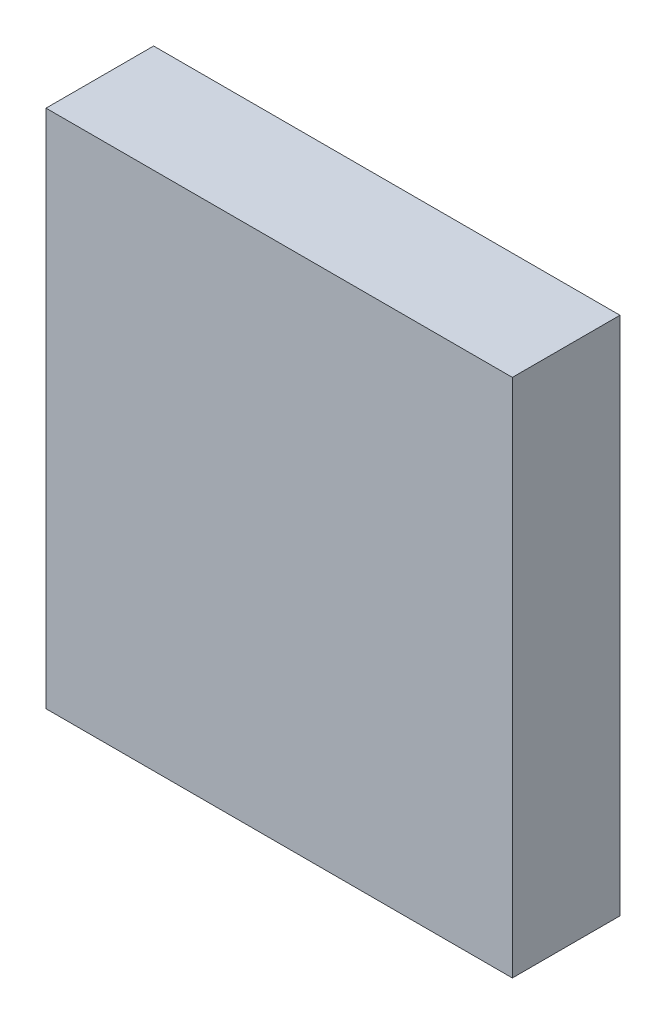
ISO-10303-21;
HEADER;
FILE_DESCRIPTION(('STEP AP214'),'2;1');
FILE_NAME('part.step','',(''),(''),'','','');
FILE_SCHEMA(('AUTOMOTIVE_DESIGN { 1 0 10303 214 1 1 1 1 }'));
ENDSEC;
DATA;
#1=APPLICATION_CONTEXT('core data for automotive mechanical design processes');
#2=APPLICATION_PROTOCOL_DEFINITION('international standard','automotive_design',2000,#1);
#3=PRODUCT_CONTEXT('',#1,'mechanical');
#4=PRODUCT('Part','Part','',(#3));
#5=PRODUCT_RELATED_PRODUCT_CATEGORY('part','',(#4));
#6=PRODUCT_DEFINITION_FORMATION('','',#4);
#7=PRODUCT_DEFINITION_CONTEXT('part definition',#1,'design');
#8=PRODUCT_DEFINITION('design','',#6,#7);
#9=PRODUCT_DEFINITION_SHAPE('','',#8);
#10=(LENGTH_UNIT() NAMED_UNIT(*) SI_UNIT(.MILLI.,.METRE.));
#11=(NAMED_UNIT(*) PLANE_ANGLE_UNIT() SI_UNIT($,.RADIAN.));
#12=(NAMED_UNIT(*) SI_UNIT($,.STERADIAN.) SOLID_ANGLE_UNIT());
#13=UNCERTAINTY_MEASURE_WITH_UNIT(LENGTH_MEASURE(1.E-05),#10,'distance_accuracy_value','');
#14=(GEOMETRIC_REPRESENTATION_CONTEXT(3) GLOBAL_UNCERTAINTY_ASSIGNED_CONTEXT((#13)) GLOBAL_UNIT_ASSIGNED_CONTEXT((#10,
#11,#12)) REPRESENTATION_CONTEXT('',''));
#15=CARTESIAN_POINT('',(0.,0.,0.));
#16=DIRECTION('',(0.,0.,1.));
#17=DIRECTION('',(1.,0.,0.));
#18=AXIS2_PLACEMENT_3D('',#15,#16,#17);
#19=CARTESIAN_POINT('',(0.,0.,0.5999988));
#20=DIRECTION('',(0.,0.,1.));
#21=DIRECTION('',(1.,0.,0.));
#22=AXIS2_PLACEMENT_3D('',#19,#20,#21);
#23=PLANE('',#22);
#24=DIRECTION('',(0.,1.,0.));
#25=VECTOR('',#24,1.);
#26=CARTESIAN_POINT('',(1.29999994,-1.44999964,0.5999988));
#27=LINE('',#26,#25);
#28=CARTESIAN_POINT('',(1.29999994,-1.44999964,0.5999988));
#29=VERTEX_POINT('',#28);
#30=CARTESIAN_POINT('',(1.29999994,1.44999964,0.5999988));
#31=VERTEX_POINT('',#30);
#32=EDGE_CURVE('E84',#29,#31,#27,.T.);
#33=ORIENTED_EDGE('',*,*,#32,.T.);
#34=DIRECTION('',(-1.,0.,0.));
#35=VECTOR('',#34,1.);
#36=CARTESIAN_POINT('',(1.29999994,1.44999964,0.5999988));
#37=LINE('',#36,#35);
#38=CARTESIAN_POINT('',(-1.29999994,1.44999964,0.5999988));
#39=VERTEX_POINT('',#38);
#40=EDGE_CURVE('E74',#31,#39,#37,.T.);
#41=ORIENTED_EDGE('',*,*,#40,.T.);
#42=DIRECTION('',(0.,-1.,0.));
#43=VECTOR('',#42,1.);
#44=CARTESIAN_POINT('',(-1.29999994,1.44999964,0.5999988));
#45=LINE('',#44,#43);
#46=CARTESIAN_POINT('',(-1.29999994,-1.44999964,0.5999988));
#47=VERTEX_POINT('',#46);
#48=EDGE_CURVE('E56',#39,#47,#45,.T.);
#49=ORIENTED_EDGE('',*,*,#48,.T.);
#50=DIRECTION('',(1.,0.,0.));
#51=VECTOR('',#50,1.);
#52=CARTESIAN_POINT('',(-1.29999994,-1.44999964,0.5999988));
#53=LINE('',#52,#51);
#54=EDGE_CURVE('E11',#47,#29,#53,.T.);
#55=ORIENTED_EDGE('',*,*,#54,.T.);
#56=EDGE_LOOP('',(#33,#41,#49,#55));
#57=FACE_BOUND('',#56,.T.);
#58=ADVANCED_FACE('F16',(#57),#23,.T.);
#59=CARTESIAN_POINT('',(0.,0.,0.));
#60=DIRECTION('',(0.,0.,1.));
#61=DIRECTION('',(1.,0.,0.));
#62=AXIS2_PLACEMENT_3D('',#59,#60,#61);
#63=PLANE('',#62);
#64=DIRECTION('',(0.,1.,0.));
#65=VECTOR('',#64,1.);
#66=CARTESIAN_POINT('',(1.29999994,-1.44999964,0.));
#67=LINE('',#66,#65);
#68=CARTESIAN_POINT('',(1.29999994,-1.44999964,0.));
#69=VERTEX_POINT('',#68);
#70=CARTESIAN_POINT('',(1.29999994,1.44999964,0.));
#71=VERTEX_POINT('',#70);
#72=EDGE_CURVE('E96',#69,#71,#67,.T.);
#73=ORIENTED_EDGE('',*,*,#72,.F.);
#74=DIRECTION('',(1.,0.,0.));
#75=VECTOR('',#74,1.);
#76=CARTESIAN_POINT('',(-1.29999994,-1.44999964,0.));
#77=LINE('',#76,#75);
#78=CARTESIAN_POINT('',(-1.29999994,-1.44999964,0.));
#79=VERTEX_POINT('',#78);
#80=EDGE_CURVE('E25',#79,#69,#77,.T.);
#81=ORIENTED_EDGE('',*,*,#80,.F.);
#82=DIRECTION('',(0.,-1.,0.));
#83=VECTOR('',#82,1.);
#84=CARTESIAN_POINT('',(-1.29999994,1.44999964,0.));
#85=LINE('',#84,#83);
#86=CARTESIAN_POINT('',(-1.29999994,1.44999964,0.));
#87=VERTEX_POINT('',#86);
#88=EDGE_CURVE('E66',#87,#79,#85,.T.);
#89=ORIENTED_EDGE('',*,*,#88,.F.);
#90=DIRECTION('',(-1.,0.,0.));
#91=VECTOR('',#90,1.);
#92=CARTESIAN_POINT('',(1.29999994,1.44999964,0.));
#93=LINE('',#92,#91);
#94=EDGE_CURVE('E79',#71,#87,#93,.T.);
#95=ORIENTED_EDGE('',*,*,#94,.F.);
#96=EDGE_LOOP('',(#73,#81,#89,#95));
#97=FACE_BOUND('',#96,.T.);
#98=ADVANCED_FACE('F176',(#97),#63,.F.);
#99=CARTESIAN_POINT('',(-1.29999994,-1.44999964,0.));
#100=DIRECTION('',(0.,1.,0.));
#101=DIRECTION('',(1.,0.,0.));
#102=AXIS2_PLACEMENT_3D('',#99,#100,#101);
#103=PLANE('',#102);
#104=DIRECTION('',(0.,0.,1.));
#105=VECTOR('',#104,1.);
#106=CARTESIAN_POINT('',(-1.29999994,-1.44999964,0.));
#107=LINE('',#106,#105);
#108=EDGE_CURVE('E105',#79,#47,#107,.T.);
#109=ORIENTED_EDGE('',*,*,#108,.F.);
#110=ORIENTED_EDGE('',*,*,#80,.T.);
#111=DIRECTION('',(0.,0.,1.));
#112=VECTOR('',#111,1.);
#113=CARTESIAN_POINT('',(1.29999994,-1.44999964,0.));
#114=LINE('',#113,#112);
#115=EDGE_CURVE('E90',#69,#29,#114,.T.);
#116=ORIENTED_EDGE('',*,*,#115,.T.);
#117=ORIENTED_EDGE('',*,*,#54,.F.);
#118=EDGE_LOOP('',(#109,#110,#116,#117));
#119=FACE_BOUND('',#118,.T.);
#120=ADVANCED_FACE('F94',(#119),#103,.F.);
#121=CARTESIAN_POINT('',(-1.29999994,1.44999964,0.));
#122=DIRECTION('',(1.,0.,0.));
#123=DIRECTION('',(0.,1.,0.));
#124=AXIS2_PLACEMENT_3D('',#121,#122,#123);
#125=PLANE('',#124);
#126=DIRECTION('',(0.,0.,1.));
#127=VECTOR('',#126,1.);
#128=CARTESIAN_POINT('',(-1.29999994,1.44999964,0.));
#129=LINE('',#128,#127);
#130=EDGE_CURVE('E116',#87,#39,#129,.T.);
#131=ORIENTED_EDGE('',*,*,#130,.F.);
#132=ORIENTED_EDGE('',*,*,#88,.T.);
#133=ORIENTED_EDGE('',*,*,#108,.T.);
#134=ORIENTED_EDGE('',*,*,#48,.F.);
#135=EDGE_LOOP('',(#131,#132,#133,#134));
#136=FACE_BOUND('',#135,.T.);
#137=ADVANCED_FACE('F159',(#136),#125,.F.);
#138=CARTESIAN_POINT('',(1.29999994,1.44999964,0.));
#139=DIRECTION('',(0.,-1.,0.));
#140=DIRECTION('',(0.,0.,-1.));
#141=AXIS2_PLACEMENT_3D('',#138,#139,#140);
#142=PLANE('',#141);
#143=DIRECTION('',(0.,0.,1.));
#144=VECTOR('',#143,1.);
#145=CARTESIAN_POINT('',(1.29999994,1.44999964,0.));
#146=LINE('',#145,#144);
#147=EDGE_CURVE('E91',#71,#31,#146,.T.);
#148=ORIENTED_EDGE('',*,*,#147,.F.);
#149=ORIENTED_EDGE('',*,*,#94,.T.);
#150=ORIENTED_EDGE('',*,*,#130,.T.);
#151=ORIENTED_EDGE('',*,*,#40,.F.);
#152=EDGE_LOOP('',(#148,#149,#150,#151));
#153=FACE_BOUND('',#152,.T.);
#154=ADVANCED_FACE('F164',(#153),#142,.F.);
#155=CARTESIAN_POINT('',(1.29999994,-1.44999964,0.));
#156=DIRECTION('',(-1.,0.,0.));
#157=DIRECTION('',(0.,0.,1.));
#158=AXIS2_PLACEMENT_3D('',#155,#156,#157);
#159=PLANE('',#158);
#160=ORIENTED_EDGE('',*,*,#115,.F.);
#161=ORIENTED_EDGE('',*,*,#72,.T.);
#162=ORIENTED_EDGE('',*,*,#147,.T.);
#163=ORIENTED_EDGE('',*,*,#32,.F.);
#164=EDGE_LOOP('',(#160,#161,#162,#163));
#165=FACE_BOUND('',#164,.T.);
#166=ADVANCED_FACE('F88',(#165),#159,.F.);
#167=CLOSED_SHELL('',(#58,#98,#120,#137,#154,#166));
#168=MANIFOLD_SOLID_BREP('B1',#167);
#169=ADVANCED_BREP_SHAPE_REPRESENTATION('',(#18,#168),#14);
#170=SHAPE_DEFINITION_REPRESENTATION(#9,#169);
ENDSEC;
END-ISO-10303-21;
